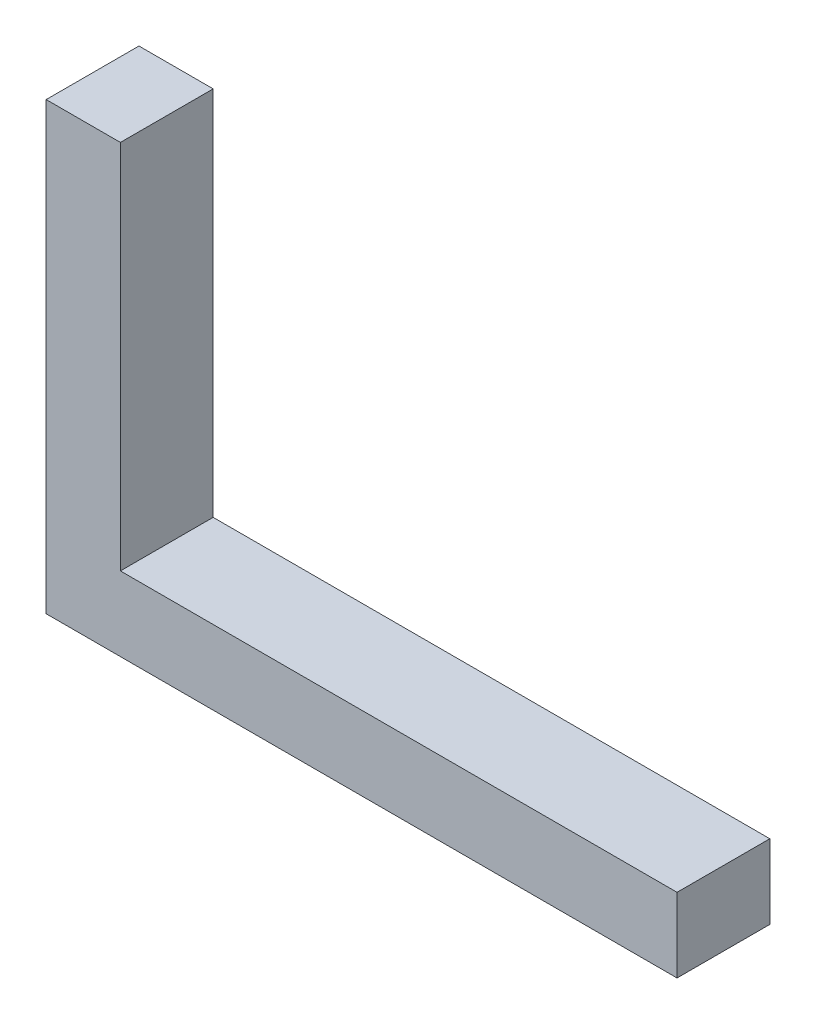
ISO-10303-21;
HEADER;
FILE_DESCRIPTION(('STEP AP214'),'2;1');
FILE_NAME('part.step','',(''),(''),'','','');
FILE_SCHEMA(('AUTOMOTIVE_DESIGN { 1 0 10303 214 1 1 1 1 }'));
ENDSEC;
DATA;
#1=APPLICATION_CONTEXT('core data for automotive mechanical design processes');
#2=APPLICATION_PROTOCOL_DEFINITION('international standard','automotive_design',2000,#1);
#3=PRODUCT_CONTEXT('',#1,'mechanical');
#4=PRODUCT('Part','Part','',(#3));
#5=PRODUCT_RELATED_PRODUCT_CATEGORY('part','',(#4));
#6=PRODUCT_DEFINITION_FORMATION('','',#4);
#7=PRODUCT_DEFINITION_CONTEXT('part definition',#1,'design');
#8=PRODUCT_DEFINITION('design','',#6,#7);
#9=PRODUCT_DEFINITION_SHAPE('','',#8);
#10=(LENGTH_UNIT() NAMED_UNIT(*) SI_UNIT(.MILLI.,.METRE.));
#11=(NAMED_UNIT(*) PLANE_ANGLE_UNIT() SI_UNIT($,.RADIAN.));
#12=(NAMED_UNIT(*) SI_UNIT($,.STERADIAN.) SOLID_ANGLE_UNIT());
#13=UNCERTAINTY_MEASURE_WITH_UNIT(LENGTH_MEASURE(1.E-05),#10,'distance_accuracy_value','');
#14=(GEOMETRIC_REPRESENTATION_CONTEXT(3) GLOBAL_UNCERTAINTY_ASSIGNED_CONTEXT((#13)) GLOBAL_UNIT_ASSIGNED_CONTEXT((#10,
#11,#12)) REPRESENTATION_CONTEXT('',''));
#15=CARTESIAN_POINT('',(0.,0.,0.));
#16=DIRECTION('',(0.,0.,1.));
#17=DIRECTION('',(1.,0.,0.));
#18=AXIS2_PLACEMENT_3D('',#15,#16,#17);
#19=CARTESIAN_POINT('',(4.,24.,5.));
#20=DIRECTION('',(0.,-1.,0.));
#21=DIRECTION('',(0.,0.,-1.));
#22=AXIS2_PLACEMENT_3D('',#19,#20,#21);
#23=PLANE('',#22);
#24=DIRECTION('',(-1.,0.,0.));
#25=VECTOR('',#24,1.);
#26=CARTESIAN_POINT('',(4.,24.,0.));
#27=LINE('',#26,#25);
#28=CARTESIAN_POINT('',(4.,24.,0.));
#29=VERTEX_POINT('',#28);
#30=CARTESIAN_POINT('',(0.,24.,0.));
#31=VERTEX_POINT('',#30);
#32=EDGE_CURVE('E117',#29,#31,#27,.T.);
#33=ORIENTED_EDGE('',*,*,#32,.T.);
#34=DIRECTION('',(0.,0.,-1.));
#35=VECTOR('',#34,1.);
#36=CARTESIAN_POINT('',(0.,24.,5.));
#37=LINE('',#36,#35);
#38=CARTESIAN_POINT('',(0.,24.,5.));
#39=VERTEX_POINT('',#38);
#40=EDGE_CURVE('E11',#39,#31,#37,.T.);
#41=ORIENTED_EDGE('',*,*,#40,.F.);
#42=DIRECTION('',(-1.,0.,0.));
#43=VECTOR('',#42,1.);
#44=CARTESIAN_POINT('',(4.,24.,5.));
#45=LINE('',#44,#43);
#46=CARTESIAN_POINT('',(4.,24.,5.));
#47=VERTEX_POINT('',#46);
#48=EDGE_CURVE('E127',#47,#39,#45,.T.);
#49=ORIENTED_EDGE('',*,*,#48,.F.);
#50=DIRECTION('',(0.,0.,-1.));
#51=VECTOR('',#50,1.);
#52=CARTESIAN_POINT('',(4.,24.,5.));
#53=LINE('',#52,#51);
#54=EDGE_CURVE('E113',#47,#29,#53,.T.);
#55=ORIENTED_EDGE('',*,*,#54,.T.);
#56=EDGE_LOOP('',(#33,#41,#49,#55));
#57=FACE_BOUND('',#56,.T.);
#58=ADVANCED_FACE('F33',(#57),#23,.F.);
#59=CARTESIAN_POINT('',(0.,24.,5.));
#60=DIRECTION('',(1.,0.,0.));
#61=DIRECTION('',(0.,1.,0.));
#62=AXIS2_PLACEMENT_3D('',#59,#60,#61);
#63=PLANE('',#62);
#64=DIRECTION('',(0.,-1.,0.));
#65=VECTOR('',#64,1.);
#66=CARTESIAN_POINT('',(0.,24.,0.));
#67=LINE('',#66,#65);
#68=CARTESIAN_POINT('',(0.,0.,0.));
#69=VERTEX_POINT('',#68);
#70=EDGE_CURVE('E120',#31,#69,#67,.T.);
#71=ORIENTED_EDGE('',*,*,#70,.T.);
#72=DIRECTION('',(0.,0.,-1.));
#73=VECTOR('',#72,1.);
#74=CARTESIAN_POINT('',(0.,0.,5.));
#75=LINE('',#74,#73);
#76=CARTESIAN_POINT('',(0.,0.,5.));
#77=VERTEX_POINT('',#76);
#78=EDGE_CURVE('E41',#77,#69,#75,.T.);
#79=ORIENTED_EDGE('',*,*,#78,.F.);
#80=DIRECTION('',(0.,-1.,0.));
#81=VECTOR('',#80,1.);
#82=CARTESIAN_POINT('',(0.,24.,5.));
#83=LINE('',#82,#81);
#84=EDGE_CURVE('E86',#39,#77,#83,.T.);
#85=ORIENTED_EDGE('',*,*,#84,.F.);
#86=ORIENTED_EDGE('',*,*,#40,.T.);
#87=EDGE_LOOP('',(#71,#79,#85,#86));
#88=FACE_BOUND('',#87,.T.);
#89=ADVANCED_FACE('F151',(#88),#63,.F.);
#90=CARTESIAN_POINT('',(0.,0.,5.));
#91=DIRECTION('',(0.,1.,0.));
#92=DIRECTION('',(0.,0.,1.));
#93=AXIS2_PLACEMENT_3D('',#90,#91,#92);
#94=PLANE('',#93);
#95=DIRECTION('',(1.,0.,0.));
#96=VECTOR('',#95,1.);
#97=CARTESIAN_POINT('',(0.,0.,0.));
#98=LINE('',#97,#96);
#99=CARTESIAN_POINT('',(34.,0.,0.));
#100=VERTEX_POINT('',#99);
#101=EDGE_CURVE('E122',#69,#100,#98,.T.);
#102=ORIENTED_EDGE('',*,*,#101,.T.);
#103=DIRECTION('',(0.,0.,-1.));
#104=VECTOR('',#103,1.);
#105=CARTESIAN_POINT('',(34.,0.,5.));
#106=LINE('',#105,#104);
#107=CARTESIAN_POINT('',(34.,0.,5.));
#108=VERTEX_POINT('',#107);
#109=EDGE_CURVE('E108',#108,#100,#106,.T.);
#110=ORIENTED_EDGE('',*,*,#109,.F.);
#111=DIRECTION('',(1.,0.,0.));
#112=VECTOR('',#111,1.);
#113=CARTESIAN_POINT('',(0.,0.,5.));
#114=LINE('',#113,#112);
#115=EDGE_CURVE('E99',#77,#108,#114,.T.);
#116=ORIENTED_EDGE('',*,*,#115,.F.);
#117=ORIENTED_EDGE('',*,*,#78,.T.);
#118=EDGE_LOOP('',(#102,#110,#116,#117));
#119=FACE_BOUND('',#118,.T.);
#120=ADVANCED_FACE('F133',(#119),#94,.F.);
#121=CARTESIAN_POINT('',(34.,0.,5.));
#122=DIRECTION('',(-1.,0.,0.));
#123=DIRECTION('',(0.,0.,1.));
#124=AXIS2_PLACEMENT_3D('',#121,#122,#123);
#125=PLANE('',#124);
#126=DIRECTION('',(0.,1.,0.));
#127=VECTOR('',#126,1.);
#128=CARTESIAN_POINT('',(34.,0.,0.));
#129=LINE('',#128,#127);
#130=CARTESIAN_POINT('',(34.,4.,0.));
#131=VERTEX_POINT('',#130);
#132=EDGE_CURVE('E107',#100,#131,#129,.T.);
#133=ORIENTED_EDGE('',*,*,#132,.T.);
#134=DIRECTION('',(0.,0.,-1.));
#135=VECTOR('',#134,1.);
#136=CARTESIAN_POINT('',(34.,4.,5.));
#137=LINE('',#136,#135);
#138=CARTESIAN_POINT('',(34.,4.,5.));
#139=VERTEX_POINT('',#138);
#140=EDGE_CURVE('E104',#139,#131,#137,.T.);
#141=ORIENTED_EDGE('',*,*,#140,.F.);
#142=DIRECTION('',(0.,1.,0.));
#143=VECTOR('',#142,1.);
#144=CARTESIAN_POINT('',(34.,0.,5.));
#145=LINE('',#144,#143);
#146=EDGE_CURVE('E93',#108,#139,#145,.T.);
#147=ORIENTED_EDGE('',*,*,#146,.F.);
#148=ORIENTED_EDGE('',*,*,#109,.T.);
#149=EDGE_LOOP('',(#133,#141,#147,#148));
#150=FACE_BOUND('',#149,.T.);
#151=ADVANCED_FACE('F105',(#150),#125,.F.);
#152=CARTESIAN_POINT('',(34.,4.,5.));
#153=DIRECTION('',(0.,-1.,0.));
#154=DIRECTION('',(1.,0.,0.));
#155=AXIS2_PLACEMENT_3D('',#152,#153,#154);
#156=PLANE('',#155);
#157=DIRECTION('',(-1.,0.,0.));
#158=VECTOR('',#157,1.);
#159=CARTESIAN_POINT('',(34.,4.,0.));
#160=LINE('',#159,#158);
#161=CARTESIAN_POINT('',(4.,4.,0.));
#162=VERTEX_POINT('',#161);
#163=EDGE_CURVE('E72',#131,#162,#160,.T.);
#164=ORIENTED_EDGE('',*,*,#163,.T.);
#165=DIRECTION('',(0.,0.,-1.));
#166=VECTOR('',#165,1.);
#167=CARTESIAN_POINT('',(4.,4.,5.));
#168=LINE('',#167,#166);
#169=CARTESIAN_POINT('',(4.,4.,5.));
#170=VERTEX_POINT('',#169);
#171=EDGE_CURVE('E109',#170,#162,#168,.T.);
#172=ORIENTED_EDGE('',*,*,#171,.F.);
#173=DIRECTION('',(-1.,0.,0.));
#174=VECTOR('',#173,1.);
#175=CARTESIAN_POINT('',(34.,4.,5.));
#176=LINE('',#175,#174);
#177=EDGE_CURVE('E97',#139,#170,#176,.T.);
#178=ORIENTED_EDGE('',*,*,#177,.F.);
#179=ORIENTED_EDGE('',*,*,#140,.T.);
#180=EDGE_LOOP('',(#164,#172,#178,#179));
#181=FACE_BOUND('',#180,.T.);
#182=ADVANCED_FACE('F111',(#181),#156,.F.);
#183=CARTESIAN_POINT('',(4.,4.,5.));
#184=DIRECTION('',(-1.,0.,0.));
#185=DIRECTION('',(0.,-1.,0.));
#186=AXIS2_PLACEMENT_3D('',#183,#184,#185);
#187=PLANE('',#186);
#188=DIRECTION('',(0.,1.,0.));
#189=VECTOR('',#188,1.);
#190=CARTESIAN_POINT('',(4.,4.,0.));
#191=LINE('',#190,#189);
#192=EDGE_CURVE('E78',#162,#29,#191,.T.);
#193=ORIENTED_EDGE('',*,*,#192,.T.);
#194=ORIENTED_EDGE('',*,*,#54,.F.);
#195=DIRECTION('',(0.,1.,0.));
#196=VECTOR('',#195,1.);
#197=CARTESIAN_POINT('',(4.,4.,5.));
#198=LINE('',#197,#196);
#199=EDGE_CURVE('E49',#170,#47,#198,.T.);
#200=ORIENTED_EDGE('',*,*,#199,.F.);
#201=ORIENTED_EDGE('',*,*,#171,.T.);
#202=EDGE_LOOP('',(#193,#194,#200,#201));
#203=FACE_BOUND('',#202,.T.);
#204=ADVANCED_FACE('F140',(#203),#187,.F.);
#205=CARTESIAN_POINT('',(0.,0.,5.));
#206=DIRECTION('',(0.,0.,1.));
#207=DIRECTION('',(1.,0.,0.));
#208=AXIS2_PLACEMENT_3D('',#205,#206,#207);
#209=PLANE('',#208);
#210=ORIENTED_EDGE('',*,*,#48,.T.);
#211=ORIENTED_EDGE('',*,*,#84,.T.);
#212=ORIENTED_EDGE('',*,*,#115,.T.);
#213=ORIENTED_EDGE('',*,*,#146,.T.);
#214=ORIENTED_EDGE('',*,*,#177,.T.);
#215=ORIENTED_EDGE('',*,*,#199,.T.);
#216=EDGE_LOOP('',(#210,#211,#212,#213,#214,#215));
#217=FACE_BOUND('',#216,.T.);
#218=ADVANCED_FACE('F95',(#217),#209,.T.);
#219=CARTESIAN_POINT('',(0.,0.,0.));
#220=DIRECTION('',(0.,0.,1.));
#221=DIRECTION('',(1.,0.,0.));
#222=AXIS2_PLACEMENT_3D('',#219,#220,#221);
#223=PLANE('',#222);
#224=ORIENTED_EDGE('',*,*,#32,.F.);
#225=ORIENTED_EDGE('',*,*,#192,.F.);
#226=ORIENTED_EDGE('',*,*,#163,.F.);
#227=ORIENTED_EDGE('',*,*,#132,.F.);
#228=ORIENTED_EDGE('',*,*,#101,.F.);
#229=ORIENTED_EDGE('',*,*,#70,.F.);
#230=EDGE_LOOP('',(#224,#225,#226,#227,#228,#229));
#231=FACE_BOUND('',#230,.T.);
#232=ADVANCED_FACE('F136',(#231),#223,.F.);
#233=CLOSED_SHELL('',(#58,#89,#120,#151,#182,#204,#218,#232));
#234=MANIFOLD_SOLID_BREP('B2',#233);
#235=ADVANCED_BREP_SHAPE_REPRESENTATION('',(#18,#234),#14);
#236=SHAPE_DEFINITION_REPRESENTATION(#9,#235);
ENDSEC;
END-ISO-10303-21;
